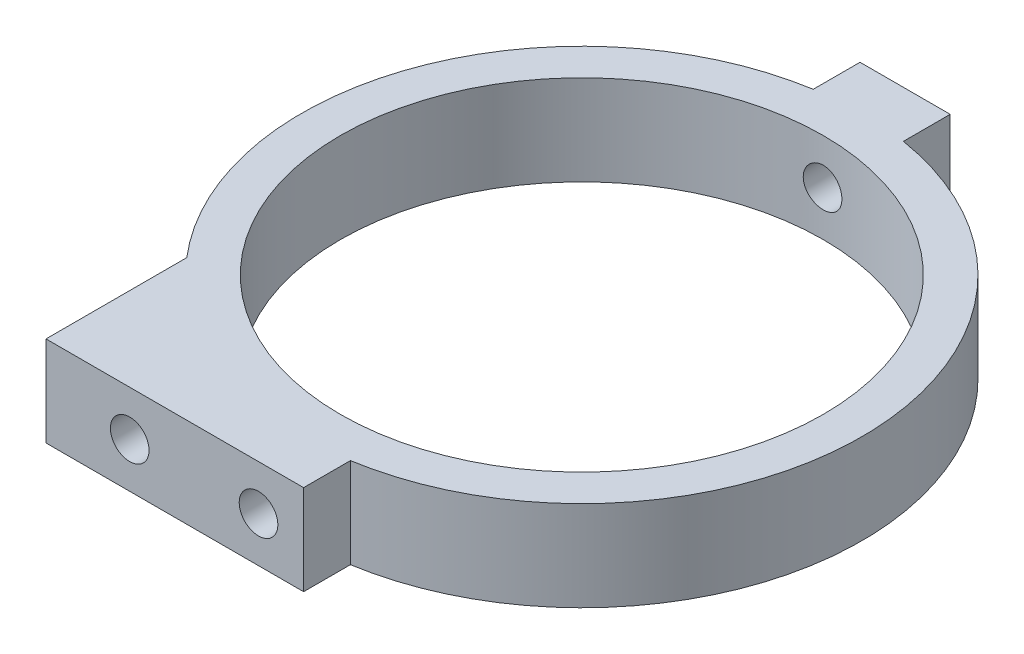
ISO-10303-21;
HEADER;
FILE_DESCRIPTION(('STEP AP214'),'2;1');
FILE_NAME('part.step','',(''),(''),'','','');
FILE_SCHEMA(('AUTOMOTIVE_DESIGN { 1 0 10303 214 1 1 1 1 }'));
ENDSEC;
DATA;
#1=APPLICATION_CONTEXT('core data for automotive mechanical design processes');
#2=APPLICATION_PROTOCOL_DEFINITION('international standard','automotive_design',2000,#1);
#3=PRODUCT_CONTEXT('',#1,'mechanical');
#4=PRODUCT('Part','Part','',(#3));
#5=PRODUCT_RELATED_PRODUCT_CATEGORY('part','',(#4));
#6=PRODUCT_DEFINITION_FORMATION('','',#4);
#7=PRODUCT_DEFINITION_CONTEXT('part definition',#1,'design');
#8=PRODUCT_DEFINITION('design','',#6,#7);
#9=PRODUCT_DEFINITION_SHAPE('','',#8);
#10=(LENGTH_UNIT() NAMED_UNIT(*) SI_UNIT(.MILLI.,.METRE.));
#11=(NAMED_UNIT(*) PLANE_ANGLE_UNIT() SI_UNIT($,.RADIAN.));
#12=(NAMED_UNIT(*) SI_UNIT($,.STERADIAN.) SOLID_ANGLE_UNIT());
#13=UNCERTAINTY_MEASURE_WITH_UNIT(LENGTH_MEASURE(1.E-05),#10,'distance_accuracy_value','');
#14=(GEOMETRIC_REPRESENTATION_CONTEXT(3) GLOBAL_UNCERTAINTY_ASSIGNED_CONTEXT((#13)) GLOBAL_UNIT_ASSIGNED_CONTEXT((#10,
#11,#12)) REPRESENTATION_CONTEXT('',''));
#15=CARTESIAN_POINT('',(0.,0.,0.));
#16=DIRECTION('',(0.,0.,1.));
#17=DIRECTION('',(1.,0.,0.));
#18=AXIS2_PLACEMENT_3D('',#15,#16,#17);
#19=CARTESIAN_POINT('',(0.,7.,0.));
#20=DIRECTION('',(0.,1.,0.));
#21=DIRECTION('',(0.,0.,-1.));
#22=AXIS2_PLACEMENT_3D('',#19,#20,#21);
#23=PLANE('',#22);
#24=DIRECTION('',(0.,0.,1.));
#25=VECTOR('',#24,1.);
#26=CARTESIAN_POINT('',(3.5,7.,-25.1));
#27=LINE('',#26,#25);
#28=CARTESIAN_POINT('',(3.5,7.,-25.1));
#29=VERTEX_POINT('',#28);
#30=CARTESIAN_POINT('',(3.5,7.,-21.4665437367081));
#31=VERTEX_POINT('',#30);
#32=EDGE_CURVE('E159',#29,#31,#27,.T.);
#33=ORIENTED_EDGE('',*,*,#32,.F.);
#34=DIRECTION('',(-1.,0.,0.));
#35=VECTOR('',#34,1.);
#36=CARTESIAN_POINT('',(3.5,7.,-25.1));
#37=LINE('',#36,#35);
#38=CARTESIAN_POINT('',(-3.5,7.,-25.1));
#39=VERTEX_POINT('',#38);
#40=EDGE_CURVE('E136',#29,#39,#37,.T.);
#41=ORIENTED_EDGE('',*,*,#40,.T.);
#42=DIRECTION('',(0.,0.,1.));
#43=VECTOR('',#42,1.);
#44=CARTESIAN_POINT('',(-3.5,7.,-25.1));
#45=LINE('',#44,#43);
#46=CARTESIAN_POINT('',(-3.5,7.,-21.4665437367081));
#47=VERTEX_POINT('',#46);
#48=EDGE_CURVE('E119',#39,#47,#45,.T.);
#49=ORIENTED_EDGE('',*,*,#48,.T.);
#50=CARTESIAN_POINT('',(0.,7.,0.));
#51=DIRECTION('',(0.,-1.,0.));
#52=DIRECTION('',(0.,0.,-1.));
#53=AXIS2_PLACEMENT_3D('',#50,#51,#52);
#54=CIRCLE('',#53,21.75);
#55=CARTESIAN_POINT('',(-16.5,7.,14.1708327207684));
#56=VERTEX_POINT('',#55);
#57=EDGE_CURVE('E128',#56,#47,#54,.T.);
#58=ORIENTED_EDGE('',*,*,#57,.F.);
#59=DIRECTION('',(0.,0.,1.));
#60=VECTOR('',#59,1.);
#61=CARTESIAN_POINT('',(-16.5,7.,25.1));
#62=LINE('',#61,#60);
#63=CARTESIAN_POINT('',(-16.5,7.,25.1));
#64=VERTEX_POINT('',#63);
#65=EDGE_CURVE('E190',#56,#64,#62,.T.);
#66=ORIENTED_EDGE('',*,*,#65,.T.);
#67=DIRECTION('',(-1.,0.,0.));
#68=VECTOR('',#67,1.);
#69=CARTESIAN_POINT('',(3.5,7.,25.1));
#70=LINE('',#69,#68);
#71=CARTESIAN_POINT('',(3.5,7.,25.1));
#72=VERTEX_POINT('',#71);
#73=EDGE_CURVE('E132',#72,#64,#70,.T.);
#74=ORIENTED_EDGE('',*,*,#73,.F.);
#75=DIRECTION('',(0.,0.,-1.));
#76=VECTOR('',#75,1.);
#77=CARTESIAN_POINT('',(3.5,7.,25.1));
#78=LINE('',#77,#76);
#79=CARTESIAN_POINT('',(3.5,7.,21.4665437367081));
#80=VERTEX_POINT('',#79);
#81=EDGE_CURVE('E175',#72,#80,#78,.T.);
#82=ORIENTED_EDGE('',*,*,#81,.T.);
#83=CARTESIAN_POINT('',(0.,7.,0.));
#84=DIRECTION('',(0.,-1.,0.));
#85=DIRECTION('',(0.,0.,-1.));
#86=AXIS2_PLACEMENT_3D('',#83,#84,#85);
#87=CIRCLE('',#86,21.75);
#88=EDGE_CURVE('E164',#31,#80,#87,.T.);
#89=ORIENTED_EDGE('',*,*,#88,.F.);
#90=EDGE_LOOP('',(#33,#41,#49,#58,#66,#74,#82,#89));
#91=FACE_BOUND('',#90,.T.);
#92=CARTESIAN_POINT('',(0.,7.,0.));
#93=DIRECTION('',(0.,-1.,0.));
#94=DIRECTION('',(0.,0.,-1.));
#95=AXIS2_PLACEMENT_3D('',#92,#93,#94);
#96=CIRCLE('',#95,18.75);
#97=CARTESIAN_POINT('',(0.,7.,-18.75));
#98=VERTEX_POINT('',#97);
#99=EDGE_CURVE('E145',#98,#98,#96,.T.);
#100=ORIENTED_EDGE('',*,*,#99,.T.);
#101=EDGE_LOOP('',(#100));
#102=FACE_BOUND('',#101,.T.);
#103=ADVANCED_FACE('F41',(#91,#102),#23,.T.);
#104=CARTESIAN_POINT('',(0.,0.,0.));
#105=DIRECTION('',(0.,1.,0.));
#106=DIRECTION('',(0.,0.,-1.));
#107=AXIS2_PLACEMENT_3D('',#104,#105,#106);
#108=PLANE('',#107);
#109=DIRECTION('',(0.,0.,1.));
#110=VECTOR('',#109,1.);
#111=CARTESIAN_POINT('',(3.5,0.,-25.1));
#112=LINE('',#111,#110);
#113=CARTESIAN_POINT('',(3.5,0.,-25.1));
#114=VERTEX_POINT('',#113);
#115=CARTESIAN_POINT('',(3.5,0.,-21.4665437367081));
#116=VERTEX_POINT('',#115);
#117=EDGE_CURVE('E141',#114,#116,#112,.T.);
#118=ORIENTED_EDGE('',*,*,#117,.T.);
#119=CARTESIAN_POINT('',(0.,0.,0.));
#120=DIRECTION('',(0.,-1.,0.));
#121=DIRECTION('',(0.,0.,-1.));
#122=AXIS2_PLACEMENT_3D('',#119,#120,#121);
#123=CIRCLE('',#122,21.75);
#124=CARTESIAN_POINT('',(3.5,0.,21.4665437367081));
#125=VERTEX_POINT('',#124);
#126=EDGE_CURVE('E144',#116,#125,#123,.T.);
#127=ORIENTED_EDGE('',*,*,#126,.T.);
#128=DIRECTION('',(0.,0.,-1.));
#129=VECTOR('',#128,1.);
#130=CARTESIAN_POINT('',(3.5,0.,25.1));
#131=LINE('',#130,#129);
#132=CARTESIAN_POINT('',(3.5,0.,25.1));
#133=VERTEX_POINT('',#132);
#134=EDGE_CURVE('E148',#133,#125,#131,.T.);
#135=ORIENTED_EDGE('',*,*,#134,.F.);
#136=DIRECTION('',(-1.,0.,0.));
#137=VECTOR('',#136,1.);
#138=CARTESIAN_POINT('',(3.5,0.,25.1));
#139=LINE('',#138,#137);
#140=CARTESIAN_POINT('',(-16.5,0.,25.1));
#141=VERTEX_POINT('',#140);
#142=EDGE_CURVE('E151',#133,#141,#139,.T.);
#143=ORIENTED_EDGE('',*,*,#142,.T.);
#144=DIRECTION('',(0.,0.,1.));
#145=VECTOR('',#144,1.);
#146=CARTESIAN_POINT('',(-16.5,0.,25.1));
#147=LINE('',#146,#145);
#148=CARTESIAN_POINT('',(-16.5,0.,14.1708327207684));
#149=VERTEX_POINT('',#148);
#150=EDGE_CURVE('E192',#149,#141,#147,.T.);
#151=ORIENTED_EDGE('',*,*,#150,.F.);
#152=CARTESIAN_POINT('',(0.,0.,0.));
#153=DIRECTION('',(0.,-1.,0.));
#154=DIRECTION('',(0.,0.,-1.));
#155=AXIS2_PLACEMENT_3D('',#152,#153,#154);
#156=CIRCLE('',#155,21.75);
#157=CARTESIAN_POINT('',(-3.5,0.,-21.4665437367081));
#158=VERTEX_POINT('',#157);
#159=EDGE_CURVE('E154',#149,#158,#156,.T.);
#160=ORIENTED_EDGE('',*,*,#159,.T.);
#161=DIRECTION('',(0.,0.,1.));
#162=VECTOR('',#161,1.);
#163=CARTESIAN_POINT('',(-3.5,0.,-25.1));
#164=LINE('',#163,#162);
#165=CARTESIAN_POINT('',(-3.5,0.,-25.1));
#166=VERTEX_POINT('',#165);
#167=EDGE_CURVE('E122',#166,#158,#164,.T.);
#168=ORIENTED_EDGE('',*,*,#167,.F.);
#169=DIRECTION('',(-1.,0.,0.));
#170=VECTOR('',#169,1.);
#171=CARTESIAN_POINT('',(3.5,0.,-25.1));
#172=LINE('',#171,#170);
#173=EDGE_CURVE('E157',#114,#166,#172,.T.);
#174=ORIENTED_EDGE('',*,*,#173,.F.);
#175=EDGE_LOOP('',(#118,#127,#135,#143,#151,#160,#168,#174));
#176=FACE_BOUND('',#175,.T.);
#177=CARTESIAN_POINT('',(0.,0.,0.));
#178=DIRECTION('',(0.,-1.,0.));
#179=DIRECTION('',(0.,0.,-1.));
#180=AXIS2_PLACEMENT_3D('',#177,#178,#179);
#181=CIRCLE('',#180,18.75);
#182=CARTESIAN_POINT('',(0.,0.,-18.75));
#183=VERTEX_POINT('',#182);
#184=EDGE_CURVE('E178',#183,#183,#181,.T.);
#185=ORIENTED_EDGE('',*,*,#184,.F.);
#186=EDGE_LOOP('',(#185));
#187=FACE_BOUND('',#186,.T.);
#188=ADVANCED_FACE('F172',(#176,#187),#108,.F.);
#189=CARTESIAN_POINT('',(3.5,7.,-25.1));
#190=DIRECTION('',(-1.,0.,0.));
#191=DIRECTION('',(0.,0.,-1.));
#192=AXIS2_PLACEMENT_3D('',#189,#190,#191);
#193=PLANE('',#192);
#194=ORIENTED_EDGE('',*,*,#117,.F.);
#195=DIRECTION('',(0.,-1.,0.));
#196=VECTOR('',#195,1.);
#197=CARTESIAN_POINT('',(3.5,7.,-25.1));
#198=LINE('',#197,#196);
#199=EDGE_CURVE('E71',#29,#114,#198,.T.);
#200=ORIENTED_EDGE('',*,*,#199,.F.);
#201=ORIENTED_EDGE('',*,*,#32,.T.);
#202=DIRECTION('',(0.,-1.,0.));
#203=VECTOR('',#202,1.);
#204=CARTESIAN_POINT('',(3.5,7.,-21.4665437367081));
#205=LINE('',#204,#203);
#206=EDGE_CURVE('E11',#31,#116,#205,.T.);
#207=ORIENTED_EDGE('',*,*,#206,.T.);
#208=EDGE_LOOP('',(#194,#200,#201,#207));
#209=FACE_BOUND('',#208,.T.);
#210=ADVANCED_FACE('F43',(#209),#193,.F.);
#211=CARTESIAN_POINT('',(0.,7.,0.));
#212=DIRECTION('',(0.,-1.,0.));
#213=DIRECTION('',(0.,0.,1.));
#214=AXIS2_PLACEMENT_3D('',#211,#212,#213);
#215=CYLINDRICAL_SURFACE('',#214,21.75);
#216=ORIENTED_EDGE('',*,*,#126,.F.);
#217=ORIENTED_EDGE('',*,*,#206,.F.);
#218=ORIENTED_EDGE('',*,*,#88,.T.);
#219=DIRECTION('',(0.,-1.,0.));
#220=VECTOR('',#219,1.);
#221=CARTESIAN_POINT('',(3.5,7.,21.4665437367081));
#222=LINE('',#221,#220);
#223=EDGE_CURVE('E55',#80,#125,#222,.T.);
#224=ORIENTED_EDGE('',*,*,#223,.T.);
#225=EDGE_LOOP('',(#216,#217,#218,#224));
#226=FACE_BOUND('',#225,.T.);
#227=ADVANCED_FACE('F163',(#226),#215,.T.);
#228=CARTESIAN_POINT('',(3.5,7.,25.1));
#229=DIRECTION('',(1.,0.,0.));
#230=DIRECTION('',(0.,0.,1.));
#231=AXIS2_PLACEMENT_3D('',#228,#229,#230);
#232=PLANE('',#231);
#233=ORIENTED_EDGE('',*,*,#134,.T.);
#234=ORIENTED_EDGE('',*,*,#223,.F.);
#235=ORIENTED_EDGE('',*,*,#81,.F.);
#236=DIRECTION('',(0.,-1.,0.));
#237=VECTOR('',#236,1.);
#238=CARTESIAN_POINT('',(3.5,7.,25.1));
#239=LINE('',#238,#237);
#240=EDGE_CURVE('E124',#72,#133,#239,.T.);
#241=ORIENTED_EDGE('',*,*,#240,.T.);
#242=EDGE_LOOP('',(#233,#234,#235,#241));
#243=FACE_BOUND('',#242,.T.);
#244=ADVANCED_FACE('F169',(#243),#232,.T.);
#245=CARTESIAN_POINT('',(3.5,7.,25.1));
#246=DIRECTION('',(0.,0.,-1.));
#247=DIRECTION('',(1.,0.,0.));
#248=AXIS2_PLACEMENT_3D('',#245,#246,#247);
#249=PLANE('',#248);
#250=CARTESIAN_POINT('',(-10.,3.5,25.1));
#251=DIRECTION('',(0.,0.,-1.));
#252=DIRECTION('',(-1.,0.,0.));
#253=AXIS2_PLACEMENT_3D('',#250,#251,#252);
#254=CIRCLE('',#253,1.5);
#255=CARTESIAN_POINT('',(-11.5,3.5,25.1));
#256=VERTEX_POINT('',#255);
#257=EDGE_CURVE('E198',#256,#256,#254,.T.);
#258=ORIENTED_EDGE('',*,*,#257,.T.);
#259=EDGE_LOOP('',(#258));
#260=FACE_BOUND('',#259,.T.);
#261=CARTESIAN_POINT('',(0.,3.5,25.1));
#262=DIRECTION('',(0.,0.,-1.));
#263=DIRECTION('',(-1.,0.,0.));
#264=AXIS2_PLACEMENT_3D('',#261,#262,#263);
#265=CIRCLE('',#264,1.5);
#266=CARTESIAN_POINT('',(-1.50000000000001,3.5,25.1));
#267=VERTEX_POINT('',#266);
#268=EDGE_CURVE('E201',#267,#267,#265,.T.);
#269=ORIENTED_EDGE('',*,*,#268,.T.);
#270=EDGE_LOOP('',(#269));
#271=FACE_BOUND('',#270,.T.);
#272=ORIENTED_EDGE('',*,*,#142,.F.);
#273=ORIENTED_EDGE('',*,*,#240,.F.);
#274=ORIENTED_EDGE('',*,*,#73,.T.);
#275=DIRECTION('',(0.,-1.,0.));
#276=VECTOR('',#275,1.);
#277=CARTESIAN_POINT('',(-16.5,7.,25.1));
#278=LINE('',#277,#276);
#279=EDGE_CURVE('E187',#64,#141,#278,.T.);
#280=ORIENTED_EDGE('',*,*,#279,.T.);
#281=EDGE_LOOP('',(#272,#273,#274,#280));
#282=FACE_BOUND('',#281,.T.);
#283=ADVANCED_FACE('F185',(#260,#271,#282),#249,.F.);
#284=CARTESIAN_POINT('',(0.,7.,0.));
#285=DIRECTION('',(0.,-1.,0.));
#286=DIRECTION('',(0.,0.,1.));
#287=AXIS2_PLACEMENT_3D('',#284,#285,#286);
#288=CYLINDRICAL_SURFACE('',#287,21.75);
#289=ORIENTED_EDGE('',*,*,#57,.T.);
#290=DIRECTION('',(0.,-1.,0.));
#291=VECTOR('',#290,1.);
#292=CARTESIAN_POINT('',(-3.5,7.,-21.4665437367081));
#293=LINE('',#292,#291);
#294=EDGE_CURVE('E116',#47,#158,#293,.T.);
#295=ORIENTED_EDGE('',*,*,#294,.T.);
#296=ORIENTED_EDGE('',*,*,#159,.F.);
#297=DIRECTION('',(0.,-1.,0.));
#298=VECTOR('',#297,1.);
#299=CARTESIAN_POINT('',(-16.5,7.,14.1708327207684));
#300=LINE('',#299,#298);
#301=EDGE_CURVE('E62',#56,#149,#300,.T.);
#302=ORIENTED_EDGE('',*,*,#301,.F.);
#303=EDGE_LOOP('',(#289,#295,#296,#302));
#304=FACE_BOUND('',#303,.T.);
#305=ADVANCED_FACE('F129',(#304),#288,.T.);
#306=CARTESIAN_POINT('',(-3.5,7.,-25.1));
#307=DIRECTION('',(-1.,0.,0.));
#308=DIRECTION('',(0.,0.,-1.));
#309=AXIS2_PLACEMENT_3D('',#306,#307,#308);
#310=PLANE('',#309);
#311=ORIENTED_EDGE('',*,*,#167,.T.);
#312=ORIENTED_EDGE('',*,*,#294,.F.);
#313=ORIENTED_EDGE('',*,*,#48,.F.);
#314=DIRECTION('',(0.,-1.,0.));
#315=VECTOR('',#314,1.);
#316=CARTESIAN_POINT('',(-3.5,7.,-25.1));
#317=LINE('',#316,#315);
#318=EDGE_CURVE('E125',#39,#166,#317,.T.);
#319=ORIENTED_EDGE('',*,*,#318,.T.);
#320=EDGE_LOOP('',(#311,#312,#313,#319));
#321=FACE_BOUND('',#320,.T.);
#322=ADVANCED_FACE('F117',(#321),#310,.T.);
#323=CARTESIAN_POINT('',(3.5,7.,-25.1));
#324=DIRECTION('',(0.,0.,-1.));
#325=DIRECTION('',(1.,0.,0.));
#326=AXIS2_PLACEMENT_3D('',#323,#324,#325);
#327=PLANE('',#326);
#328=CARTESIAN_POINT('',(0.,3.5,-25.1));
#329=DIRECTION('',(0.,0.,1.));
#330=DIRECTION('',(1.,0.,0.));
#331=AXIS2_PLACEMENT_3D('',#328,#329,#330);
#332=CIRCLE('',#331,1.5);
#333=CARTESIAN_POINT('',(1.5,3.5,-25.1));
#334=VERTEX_POINT('',#333);
#335=EDGE_CURVE('E206',#334,#334,#332,.T.);
#336=ORIENTED_EDGE('',*,*,#335,.T.);
#337=EDGE_LOOP('',(#336));
#338=FACE_BOUND('',#337,.T.);
#339=ORIENTED_EDGE('',*,*,#173,.T.);
#340=ORIENTED_EDGE('',*,*,#318,.F.);
#341=ORIENTED_EDGE('',*,*,#40,.F.);
#342=ORIENTED_EDGE('',*,*,#199,.T.);
#343=EDGE_LOOP('',(#339,#340,#341,#342));
#344=FACE_BOUND('',#343,.T.);
#345=ADVANCED_FACE('F227',(#338,#344),#327,.T.);
#346=CARTESIAN_POINT('',(0.,7.,0.));
#347=DIRECTION('',(0.,-1.,0.));
#348=DIRECTION('',(0.,0.,1.));
#349=AXIS2_PLACEMENT_3D('',#346,#347,#348);
#350=CYLINDRICAL_SURFACE('',#349,18.75);
#351=CARTESIAN_POINT('',(1.5,3.5,-18.6899036915657));
#352=CARTESIAN_POINT('',(1.49999632062772,3.41588910974437,-18.6899044892014));
#353=CARTESIAN_POINT('',(1.49290156215183,3.3317206652062,-18.6904775942158));
#354=CARTESIAN_POINT('',(1.46470318774386,3.16571175768858,-18.6927081206783));
#355=CARTESIAN_POINT('',(1.44358362109166,3.08387405616433,-18.6943667767162));
#356=CARTESIAN_POINT('',(1.38794959023862,2.92495508136651,-18.6985793452206));
#357=CARTESIAN_POINT('',(1.35344262614257,2.84787117282067,-18.7011327563356));
#358=CARTESIAN_POINT('',(1.27202646042832,2.70060821925846,-18.7068465005001));
#359=CARTESIAN_POINT('',(1.22511994393665,2.630427683824,-18.7100067021084));
#360=CARTESIAN_POINT('',(1.12011551831489,2.49877819168836,-18.7165863916315));
#361=CARTESIAN_POINT('',(1.06199424933048,2.43732789187484,-18.7200064115608));
#362=CARTESIAN_POINT('',(0.936259445760343,2.32504341460093,-18.7267155033906));
#363=CARTESIAN_POINT('',(0.868645500088394,2.27420969713547,-18.7300045696121));
#364=CARTESIAN_POINT('',(0.725734168475946,2.18453992472742,-18.7360861453358));
#365=CARTESIAN_POINT('',(0.650426681655086,2.14571991903267,-18.738877988498));
#366=CARTESIAN_POINT('',(0.494336491088885,2.08128219450257,-18.7436448358792));
#367=CARTESIAN_POINT('',(0.413553876517281,2.05566426070272,-18.745619853398));
#368=CARTESIAN_POINT('',(0.248991495760869,2.01841132760336,-18.7485268054688));
#369=CARTESIAN_POINT('',(0.165218575252358,2.00674626571047,-18.7494609822974));
#370=CARTESIAN_POINT('',(-0.00310101422522166,1.99763728747693,-18.7501885880184));
#371=CARTESIAN_POINT('',(-0.0876476697940369,2.00019312530925,-18.7499820366297));
#372=CARTESIAN_POINT('',(-0.254910958845742,2.01942877416144,-18.7484533122186));
#373=CARTESIAN_POINT('',(-0.337631336820587,2.03607625616637,-18.7471336928186));
#374=CARTESIAN_POINT('',(-0.499099950189813,2.08297238129014,-18.7435302217384));
#375=CARTESIAN_POINT('',(-0.577848150305161,2.11322114518559,-18.7412463614959));
#376=CARTESIAN_POINT('',(-0.729240075628612,2.18649731782168,-18.7359669873138));
#377=CARTESIAN_POINT('',(-0.801876748665349,2.22953923615441,-18.7329706660993));
#378=CARTESIAN_POINT('',(-0.938906754389632,2.32716937813201,-18.7266031809033));
#379=CARTESIAN_POINT('',(-1.00329993315168,2.38175781732721,-18.7232320099247));
#380=CARTESIAN_POINT('',(-1.12220402922705,2.50111371219672,-18.716482638835));
#381=CARTESIAN_POINT('',(-1.17668675797546,2.56590925405083,-18.7131044454878));
#382=CARTESIAN_POINT('',(-1.27400569041641,2.70374207490187,-18.7067312907922));
#383=CARTESIAN_POINT('',(-1.31684188556444,2.77677935994532,-18.7037363297249));
#384=CARTESIAN_POINT('',(-1.38965054864154,2.92904186429338,-18.6984681334495));
#385=CARTESIAN_POINT('',(-1.41962160308561,3.00826776240737,-18.6961949775527));
#386=CARTESIAN_POINT('',(-1.46582859989257,3.17064933913142,-18.6926292502436));
#387=CARTESIAN_POINT('',(-1.48206480809471,3.25380494164879,-18.6913366598524));
#388=CARTESIAN_POINT('',(-1.50030564278629,3.4214389223715,-18.6898814380755));
#389=CARTESIAN_POINT('',(-1.50234955607957,3.50591299971711,-18.6897156874231));
#390=CARTESIAN_POINT('',(-1.49225064585172,3.67400262104635,-18.690524676209));
#391=CARTESIAN_POINT('',(-1.48010794413208,3.75761817239478,-18.6914994058556));
#392=CARTESIAN_POINT('',(-1.44201322164018,3.92150472101421,-18.6944766801575));
#393=CARTESIAN_POINT('',(-1.41607949196744,4.00177999680187,-18.6964778632987));
#394=CARTESIAN_POINT('',(-1.35115745890298,4.15683972413565,-18.7012814234103));
#395=CARTESIAN_POINT('',(-1.31216896221481,4.23162409436024,-18.7040838122436));
#396=CARTESIAN_POINT('',(-1.22214454706965,4.373759059463,-18.7101815822911));
#397=CARTESIAN_POINT('',(-1.17108242281578,4.44109300986021,-18.7134780300796));
#398=CARTESIAN_POINT('',(-1.05839811840015,4.5662476479122,-18.7201888557784));
#399=CARTESIAN_POINT('',(-0.996775770633618,4.62406818454792,-18.7236032355598));
#400=CARTESIAN_POINT('',(-0.864550602263586,4.72868853250665,-18.7301744660023));
#401=CARTESIAN_POINT('',(-0.793927565253147,4.77546283652398,-18.7333307098241));
#402=CARTESIAN_POINT('',(-0.645806640765806,4.85648803992158,-18.7390213036078));
#403=CARTESIAN_POINT('',(-0.568308817352759,4.89073905598699,-18.7415556593639));
#404=CARTESIAN_POINT('',(-0.408730022480179,4.94570151548968,-18.7457141148762));
#405=CARTESIAN_POINT('',(-0.326654535286603,4.96642879824313,-18.7473392791795));
#406=CARTESIAN_POINT('',(-0.160174833719194,4.99380720003187,-18.7495005498768));
#407=CARTESIAN_POINT('',(-0.0757706596510529,5.00045856254326,-18.7500366751083));
#408=CARTESIAN_POINT('',(0.0927188866521085,4.99949357241986,-18.7499594956931));
#409=CARTESIAN_POINT('',(0.176804491059185,4.99191700058234,-18.7493493958487));
#410=CARTESIAN_POINT('',(0.342505049325764,4.96279408533884,-18.7470546664287));
#411=CARTESIAN_POINT('',(0.424119999621,4.94124772178048,-18.7453700353031));
#412=CARTESIAN_POINT('',(0.58256563894844,4.88480677611825,-18.7411153164152));
#413=CARTESIAN_POINT('',(0.6593965525984,4.8499128212543,-18.7385452702617));
#414=CARTESIAN_POINT('',(0.806115934271487,4.76777187152803,-18.7328074295552));
#415=CARTESIAN_POINT('',(0.8760045245382,4.72052509423304,-18.7296396455302));
#416=CARTESIAN_POINT('',(1.00705879886138,4.61487049786707,-18.7230514806532));
#417=CARTESIAN_POINT('',(1.06820077293534,4.55643330967203,-18.7196304499822));
#418=CARTESIAN_POINT('',(1.17983224819666,4.43010829215942,-18.7129268703636));
#419=CARTESIAN_POINT('',(1.23031916134281,4.36221817342083,-18.709644355215));
#420=CARTESIAN_POINT('',(1.31927004620408,4.21879254913323,-18.7035831840147));
#421=CARTESIAN_POINT('',(1.35771272607774,4.14324381313022,-18.7008054238702));
#422=CARTESIAN_POINT('',(1.42131855200279,3.98679387767989,-18.6960792751499));
#423=CARTESIAN_POINT('',(1.44649701682099,3.90589897459956,-18.6941299303474));
#424=CARTESIAN_POINT('',(1.47642337958161,3.77043630193827,-18.691784377361));
#425=CARTESIAN_POINT('',(1.48525291732771,3.71674059854125,-18.6910823459044));
#426=CARTESIAN_POINT('',(1.49704240943925,3.60870461027899,-18.6901417457999));
#427=CARTESIAN_POINT('',(1.5000023781296,3.55436432698718,-18.6899031760209));
#428=CARTESIAN_POINT('',(1.5,3.5,-18.6899036915657));
#429=B_SPLINE_CURVE_WITH_KNOTS('',3,(#351,#352,#353,#354,#355,#356,#357,#358,#359,#360,#361,
#362,#363,#364,#365,#366,#367,#368,#369,#370,#371,#372,#373,#374,#375,#376,#377,#378,#379,#380,
#381,#382,#383,#384,#385,#386,#387,#388,#389,#390,#391,#392,#393,#394,#395,#396,#397,#398,#399,
#400,#401,#402,#403,#404,#405,#406,#407,#408,#409,#410,#411,#412,#413,#414,#415,#416,#417,#418,
#419,#420,#421,#422,#423,#424,#425,#426,#427,#428),.UNSPECIFIED.,.T.,.F.,(4,2,2,2,2,2,2,2,2,2,2,
2,2,2,2,2,2,2,2,2,2,2,2,2,2,2,2,2,2,2,2,2,2,2,2,2,2,2,4),(0.,0.25213418203791,0.50455561402385,
0.756835834120728,1.00906146755583,1.26181826116902,1.51458600394927,1.7676899785965,
2.02078983191417,2.27334337309686,2.52589254857181,2.77786389180794,3.02983747254223,
3.28209793140011,3.53436309986935,3.78733494058949,4.0403069669025,4.29330677998519,
4.54630169612057,4.79859599700462,5.05088813179099,5.30284648195618,5.55480856292754,
5.80732263043169,6.05984070604075,6.31293630132195,6.56602953833693,6.8188258119051,
7.07161771273227,7.32370386856552,7.5757903880512,7.82786506275495,8.07993529802616,
8.33267638790938,8.5854787963961,8.83872562068804,9.09167932690653,9.25464441416333,
9.41760910369755),.UNSPECIFIED.);
#430=CARTESIAN_POINT('',(1.5,3.5,-18.6899036915657));
#431=VERTEX_POINT('',#430);
#432=EDGE_CURVE('E45',#431,#431,#429,.T.);
#433=ORIENTED_EDGE('',*,*,#432,.T.);
#434=EDGE_LOOP('',(#433));
#435=FACE_BOUND('',#434,.T.);
#436=ORIENTED_EDGE('',*,*,#99,.F.);
#437=EDGE_LOOP('',(#436));
#438=FACE_BOUND('',#437,.T.);
#439=ORIENTED_EDGE('',*,*,#184,.T.);
#440=EDGE_LOOP('',(#439));
#441=FACE_BOUND('',#440,.T.);
#442=ADVANCED_FACE('F218',(#435,#438,#441),#350,.F.);
#443=CARTESIAN_POINT('',(0.,3.5,-18.1));
#444=DIRECTION('',(0.,0.,-1.));
#445=DIRECTION('',(1.,0.,0.));
#446=AXIS2_PLACEMENT_3D('',#443,#444,#445);
#447=CYLINDRICAL_SURFACE('',#446,1.5);
#448=ORIENTED_EDGE('',*,*,#432,.F.);
#449=EDGE_LOOP('',(#448));
#450=FACE_BOUND('',#449,.T.);
#451=ORIENTED_EDGE('',*,*,#335,.F.);
#452=EDGE_LOOP('',(#451));
#453=FACE_BOUND('',#452,.T.);
#454=ADVANCED_FACE('F221',(#450,#453),#447,.F.);
#455=CARTESIAN_POINT('',(0.,3.5,20.1));
#456=DIRECTION('',(0.,0.,1.));
#457=DIRECTION('',(-1.,0.,0.));
#458=AXIS2_PLACEMENT_3D('',#455,#456,#457);
#459=CYLINDRICAL_SURFACE('',#458,1.5);
#460=CARTESIAN_POINT('',(0.,3.5,20.1));
#461=DIRECTION('',(0.,0.,-1.));
#462=DIRECTION('',(-1.,0.,0.));
#463=AXIS2_PLACEMENT_3D('',#460,#461,#462);
#464=CIRCLE('',#463,1.5);
#465=CARTESIAN_POINT('',(-1.5,3.5,20.1));
#466=VERTEX_POINT('',#465);
#467=EDGE_CURVE('E203',#466,#466,#464,.T.);
#468=ORIENTED_EDGE('',*,*,#467,.T.);
#469=EDGE_LOOP('',(#468));
#470=FACE_BOUND('',#469,.T.);
#471=ORIENTED_EDGE('',*,*,#268,.F.);
#472=EDGE_LOOP('',(#471));
#473=FACE_BOUND('',#472,.T.);
#474=ADVANCED_FACE('F224',(#470,#473),#459,.F.);
#475=CARTESIAN_POINT('',(0.,3.5,20.1));
#476=DIRECTION('',(0.,0.,1.));
#477=DIRECTION('',(-1.,0.,0.));
#478=AXIS2_PLACEMENT_3D('',#475,#476,#477);
#479=PLANE('',#478);
#480=ORIENTED_EDGE('',*,*,#467,.F.);
#481=EDGE_LOOP('',(#480));
#482=FACE_BOUND('',#481,.T.);
#483=ADVANCED_FACE('F235',(#482),#479,.T.);
#484=CARTESIAN_POINT('',(-16.5,7.,25.1));
#485=DIRECTION('',(-1.,0.,0.));
#486=DIRECTION('',(0.,0.,-1.));
#487=AXIS2_PLACEMENT_3D('',#484,#485,#486);
#488=PLANE('',#487);
#489=ORIENTED_EDGE('',*,*,#150,.T.);
#490=ORIENTED_EDGE('',*,*,#279,.F.);
#491=ORIENTED_EDGE('',*,*,#65,.F.);
#492=ORIENTED_EDGE('',*,*,#301,.T.);
#493=EDGE_LOOP('',(#489,#490,#491,#492));
#494=FACE_BOUND('',#493,.T.);
#495=ADVANCED_FACE('F232',(#494),#488,.T.);
#496=CARTESIAN_POINT('',(-10.,3.5,18.1));
#497=DIRECTION('',(0.,0.,1.));
#498=DIRECTION('',(-1.,0.,0.));
#499=AXIS2_PLACEMENT_3D('',#496,#497,#498);
#500=CYLINDRICAL_SURFACE('',#499,1.5);
#501=CARTESIAN_POINT('',(-10.,3.5,18.1));
#502=DIRECTION('',(0.,0.,-1.));
#503=DIRECTION('',(-1.,0.,0.));
#504=AXIS2_PLACEMENT_3D('',#501,#502,#503);
#505=CIRCLE('',#504,1.5);
#506=CARTESIAN_POINT('',(-11.5,3.5,18.1));
#507=VERTEX_POINT('',#506);
#508=EDGE_CURVE('E195',#507,#507,#505,.T.);
#509=ORIENTED_EDGE('',*,*,#508,.T.);
#510=EDGE_LOOP('',(#509));
#511=FACE_BOUND('',#510,.T.);
#512=ORIENTED_EDGE('',*,*,#257,.F.);
#513=EDGE_LOOP('',(#512));
#514=FACE_BOUND('',#513,.T.);
#515=ADVANCED_FACE('F234',(#511,#514),#500,.F.);
#516=CARTESIAN_POINT('',(-10.,3.5,18.1));
#517=DIRECTION('',(0.,0.,1.));
#518=DIRECTION('',(-1.,0.,0.));
#519=AXIS2_PLACEMENT_3D('',#516,#517,#518);
#520=PLANE('',#519);
#521=ORIENTED_EDGE('',*,*,#508,.F.);
#522=EDGE_LOOP('',(#521));
#523=FACE_BOUND('',#522,.T.);
#524=ADVANCED_FACE('F241',(#523),#520,.T.);
#525=CLOSED_SHELL('',(#103,#188,#210,#227,#244,#283,#305,#322,#345,#442,#454,#474,#483,#495,
#515,#524));
#526=MANIFOLD_SOLID_BREP('B2',#525);
#527=ADVANCED_BREP_SHAPE_REPRESENTATION('',(#18,#526),#14);
#528=SHAPE_DEFINITION_REPRESENTATION(#9,#527);
ENDSEC;
END-ISO-10303-21;
